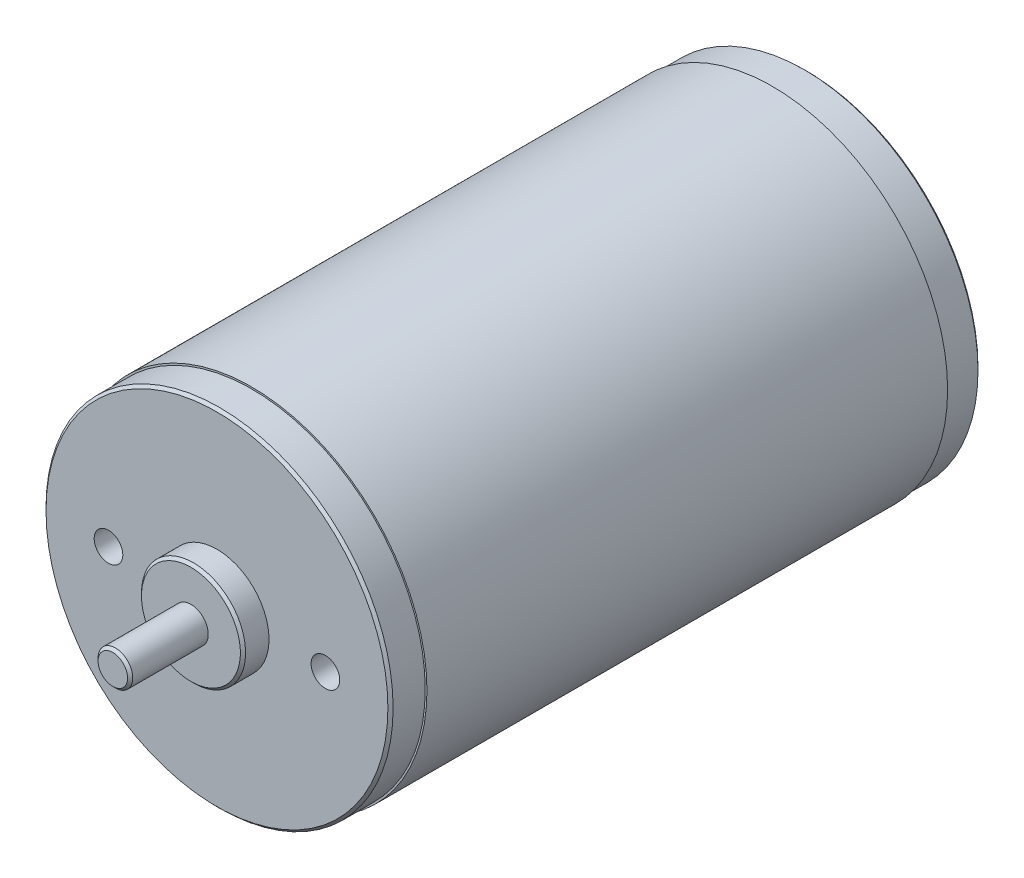
ISO-10303-21;
HEADER;
FILE_DESCRIPTION(('STEP AP214'),'2;1');
FILE_NAME('part.step','',(''),(''),'','','');
FILE_SCHEMA(('AUTOMOTIVE_DESIGN { 1 0 10303 214 1 1 1 1 }'));
ENDSEC;
DATA;
#1=APPLICATION_CONTEXT('core data for automotive mechanical design processes');
#2=APPLICATION_PROTOCOL_DEFINITION('international standard','automotive_design',2000,#1);
#3=PRODUCT_CONTEXT('',#1,'mechanical');
#4=PRODUCT('Part','Part','',(#3));
#5=PRODUCT_RELATED_PRODUCT_CATEGORY('part','',(#4));
#6=PRODUCT_DEFINITION_FORMATION('','',#4);
#7=PRODUCT_DEFINITION_CONTEXT('part definition',#1,'design');
#8=PRODUCT_DEFINITION('design','',#6,#7);
#9=PRODUCT_DEFINITION_SHAPE('','',#8);
#10=(LENGTH_UNIT() NAMED_UNIT(*) SI_UNIT(.MILLI.,.METRE.));
#11=(NAMED_UNIT(*) PLANE_ANGLE_UNIT() SI_UNIT($,.RADIAN.));
#12=(NAMED_UNIT(*) SI_UNIT($,.STERADIAN.) SOLID_ANGLE_UNIT());
#13=UNCERTAINTY_MEASURE_WITH_UNIT(LENGTH_MEASURE(1.E-05),#10,'distance_accuracy_value','');
#14=(GEOMETRIC_REPRESENTATION_CONTEXT(3) GLOBAL_UNCERTAINTY_ASSIGNED_CONTEXT((#13)) GLOBAL_UNIT_ASSIGNED_CONTEXT((#10,
#11,#12)) REPRESENTATION_CONTEXT('',''));
#15=CARTESIAN_POINT('',(0.,0.,0.));
#16=DIRECTION('',(0.,0.,1.));
#17=DIRECTION('',(1.,0.,0.));
#18=AXIS2_PLACEMENT_3D('',#15,#16,#17);
#19=CARTESIAN_POINT('',(0.,0.,12.));
#20=DIRECTION('',(0.,0.,1.));
#21=DIRECTION('',(1.,0.,0.));
#22=AXIS2_PLACEMENT_3D('',#19,#20,#21);
#23=PLANE('',#22);
#24=CARTESIAN_POINT('',(0.,0.,12.0000000000573));
#25=DIRECTION('',(0.,0.,-1.));
#26=DIRECTION('',(-1.,0.,0.));
#27=AXIS2_PLACEMENT_3D('',#24,#25,#26);
#28=CIRCLE('',#27,1.70000000002801);
#29=CARTESIAN_POINT('',(-1.70000000002801,0.,12.0000000000573));
#30=VERTEX_POINT('',#29);
#31=EDGE_CURVE('E19',#30,#30,#28,.T.);
#32=ORIENTED_EDGE('',*,*,#31,.F.);
#33=EDGE_LOOP('',(#32));
#34=FACE_BOUND('',#33,.T.);
#35=ADVANCED_FACE('F16',(#34),#23,.T.);
#36=CARTESIAN_POINT('',(0.,0.,11.7000000000758));
#37=DIRECTION('',(0.,0.,-1.));
#38=DIRECTION('',(-1.,0.,0.));
#39=AXIS2_PLACEMENT_3D('',#36,#37,#38);
#40=CONICAL_SURFACE('',#39,2.00000000000955,0.785398163397448);
#41=CARTESIAN_POINT('',(0.,0.,11.7));
#42=DIRECTION('',(0.,0.,-1.));
#43=DIRECTION('',(-1.,0.,0.));
#44=AXIS2_PLACEMENT_3D('',#41,#42,#43);
#45=CIRCLE('',#44,2.);
#46=CARTESIAN_POINT('',(-2.,0.,11.7));
#47=VERTEX_POINT('',#46);
#48=EDGE_CURVE('E52',#47,#47,#45,.T.);
#49=ORIENTED_EDGE('',*,*,#48,.F.);
#50=EDGE_LOOP('',(#49));
#51=FACE_BOUND('',#50,.T.);
#52=ORIENTED_EDGE('',*,*,#31,.T.);
#53=EDGE_LOOP('',(#52));
#54=FACE_BOUND('',#53,.T.);
#55=ADVANCED_FACE('F98',(#51,#54),#40,.T.);
#56=CARTESIAN_POINT('',(0.,0.,12.));
#57=DIRECTION('',(0.,0.,-1.));
#58=DIRECTION('',(-1.,0.,0.));
#59=AXIS2_PLACEMENT_3D('',#56,#57,#58);
#60=CYLINDRICAL_SURFACE('',#59,2.);
#61=CARTESIAN_POINT('',(0.,0.,3.));
#62=DIRECTION('',(0.,0.,-1.));
#63=DIRECTION('',(-1.,0.,0.));
#64=AXIS2_PLACEMENT_3D('',#61,#62,#63);
#65=CIRCLE('',#64,2.);
#66=CARTESIAN_POINT('',(-2.,0.,3.));
#67=VERTEX_POINT('',#66);
#68=EDGE_CURVE('E54',#67,#67,#65,.T.);
#69=ORIENTED_EDGE('',*,*,#68,.F.);
#70=EDGE_LOOP('',(#69));
#71=FACE_BOUND('',#70,.T.);
#72=ORIENTED_EDGE('',*,*,#48,.T.);
#73=EDGE_LOOP('',(#72));
#74=FACE_BOUND('',#73,.T.);
#75=ADVANCED_FACE('F94',(#71,#74),#60,.T.);
#76=CARTESIAN_POINT('',(0.,0.,-69.5));
#77=DIRECTION('',(0.,0.,-1.));
#78=DIRECTION('',(-1.,0.,0.));
#79=AXIS2_PLACEMENT_3D('',#76,#77,#78);
#80=PLANE('',#79);
#81=CARTESIAN_POINT('',(0.,0.,-69.5000000000618));
#82=DIRECTION('',(0.,0.,1.));
#83=DIRECTION('',(1.,0.,0.));
#84=AXIS2_PLACEMENT_3D('',#81,#82,#83);
#85=CIRCLE('',#84,6.02500000002237);
#86=CARTESIAN_POINT('',(6.02500000002237,0.,-69.5000000000618));
#87=VERTEX_POINT('',#86);
#88=EDGE_CURVE('E86',#87,#87,#85,.T.);
#89=ORIENTED_EDGE('',*,*,#88,.F.);
#90=EDGE_LOOP('',(#89));
#91=FACE_BOUND('',#90,.T.);
#92=ADVANCED_FACE('F97',(#91),#80,.T.);
#93=CARTESIAN_POINT('',(0.,0.,3.));
#94=DIRECTION('',(0.,0.,1.));
#95=DIRECTION('',(1.,0.,0.));
#96=AXIS2_PLACEMENT_3D('',#93,#94,#95);
#97=PLANE('',#96);
#98=ORIENTED_EDGE('',*,*,#68,.T.);
#99=EDGE_LOOP('',(#98));
#100=FACE_BOUND('',#99,.T.);
#101=CARTESIAN_POINT('',(0.,0.,2.9999999999859));
#102=DIRECTION('',(0.,0.,-1.));
#103=DIRECTION('',(-1.,0.,0.));
#104=AXIS2_PLACEMENT_3D('',#101,#102,#103);
#105=CIRCLE('',#104,5.70000000004711);
#106=CARTESIAN_POINT('',(-5.70000000004711,0.,2.9999999999859));
#107=VERTEX_POINT('',#106);
#108=EDGE_CURVE('E48',#107,#107,#105,.T.);
#109=ORIENTED_EDGE('',*,*,#108,.F.);
#110=EDGE_LOOP('',(#109));
#111=FACE_BOUND('',#110,.T.);
#112=ADVANCED_FACE('F91',(#100,#111),#97,.T.);
#113=CARTESIAN_POINT('',(0.,0.,-69.2000000000803));
#114=DIRECTION('',(0.,0.,1.));
#115=DIRECTION('',(1.,0.,0.));
#116=AXIS2_PLACEMENT_3D('',#113,#114,#115);
#117=CONICAL_SURFACE('',#116,6.32500000000391,0.785398163397448);
#118=ORIENTED_EDGE('',*,*,#88,.T.);
#119=EDGE_LOOP('',(#118));
#120=FACE_BOUND('',#119,.T.);
#121=CARTESIAN_POINT('',(0.,0.,-69.2));
#122=DIRECTION('',(0.,0.,1.));
#123=DIRECTION('',(1.,0.,0.));
#124=AXIS2_PLACEMENT_3D('',#121,#122,#123);
#125=CIRCLE('',#124,6.325);
#126=CARTESIAN_POINT('',(6.325,0.,-69.2));
#127=VERTEX_POINT('',#126);
#128=EDGE_CURVE('E42',#127,#127,#125,.T.);
#129=ORIENTED_EDGE('',*,*,#128,.F.);
#130=EDGE_LOOP('',(#129));
#131=FACE_BOUND('',#130,.T.);
#132=ADVANCED_FACE('F35',(#120,#131),#117,.T.);
#133=CARTESIAN_POINT('',(-12.5,0.,-8.10000000012678));
#134=DIRECTION('',(0.,0.,1.));
#135=DIRECTION('',(1.,0.,0.));
#136=AXIS2_PLACEMENT_3D('',#133,#134,#135);
#137=CONICAL_SURFACE('',#136,1.6499999998814,1.02974425849465);
#138=CARTESIAN_POINT('',(-12.5000000002728,0.,-9.09142002154795));
#139=VERTEX_POINT('',#138);
#140=VERTEX_LOOP('',#139);
#141=FACE_BOUND('',#140,.T.);
#142=CARTESIAN_POINT('',(-12.5,0.,-8.1));
#143=DIRECTION('',(0.,0.,1.));
#144=DIRECTION('',(1.,0.,0.));
#145=AXIS2_PLACEMENT_3D('',#142,#143,#144);
#146=CIRCLE('',#145,1.65);
#147=CARTESIAN_POINT('',(-10.85,0.,-8.1));
#148=VERTEX_POINT('',#147);
#149=EDGE_CURVE('E39',#148,#148,#146,.T.);
#150=ORIENTED_EDGE('',*,*,#149,.T.);
#151=EDGE_LOOP('',(#150));
#152=FACE_BOUND('',#151,.T.);
#153=ADVANCED_FACE('F31',(#141,#152),#137,.F.);
#154=CARTESIAN_POINT('',(12.5,0.,-8.10000000012678));
#155=DIRECTION('',(0.,0.,1.));
#156=DIRECTION('',(1.,0.,0.));
#157=AXIS2_PLACEMENT_3D('',#154,#155,#156);
#158=CONICAL_SURFACE('',#157,1.64999999985866,1.02974425848248);
#159=CARTESIAN_POINT('',(12.4999999997328,0.,-9.09142002157637));
#160=VERTEX_POINT('',#159);
#161=VERTEX_LOOP('',#160);
#162=FACE_BOUND('',#161,.T.);
#163=CARTESIAN_POINT('',(12.5,0.,-8.1));
#164=DIRECTION('',(0.,0.,1.));
#165=DIRECTION('',(1.,0.,0.));
#166=AXIS2_PLACEMENT_3D('',#163,#164,#165);
#167=CIRCLE('',#166,1.65);
#168=CARTESIAN_POINT('',(14.15,0.,-8.1));
#169=VERTEX_POINT('',#168);
#170=EDGE_CURVE('E41',#169,#169,#167,.T.);
#171=ORIENTED_EDGE('',*,*,#170,.T.);
#172=EDGE_LOOP('',(#171));
#173=FACE_BOUND('',#172,.T.);
#174=ADVANCED_FACE('F34',(#162,#173),#158,.F.);
#175=CARTESIAN_POINT('',(0.,0.,2.70000000000437));
#176=DIRECTION('',(0.,0.,-1.));
#177=DIRECTION('',(-1.,0.,0.));
#178=AXIS2_PLACEMENT_3D('',#175,#176,#177);
#179=CONICAL_SURFACE('',#178,6.00000000002865,0.785398163397448);
#180=CARTESIAN_POINT('',(0.,0.,2.70000000000002));
#181=DIRECTION('',(0.,0.,-1.));
#182=DIRECTION('',(-1.,0.,0.));
#183=AXIS2_PLACEMENT_3D('',#180,#181,#182);
#184=CIRCLE('',#183,6.);
#185=CARTESIAN_POINT('',(-6.,0.,2.70000000000002));
#186=VERTEX_POINT('',#185);
#187=EDGE_CURVE('E45',#186,#186,#184,.T.);
#188=ORIENTED_EDGE('',*,*,#187,.F.);
#189=EDGE_LOOP('',(#188));
#190=FACE_BOUND('',#189,.T.);
#191=ORIENTED_EDGE('',*,*,#108,.T.);
#192=EDGE_LOOP('',(#191));
#193=FACE_BOUND('',#192,.T.);
#194=ADVANCED_FACE('F166',(#190,#193),#179,.T.);
#195=CARTESIAN_POINT('',(0.,0.,-69.5));
#196=DIRECTION('',(0.,0.,1.));
#197=DIRECTION('',(1.,0.,0.));
#198=AXIS2_PLACEMENT_3D('',#195,#196,#197);
#199=CYLINDRICAL_SURFACE('',#198,6.325);
#200=ORIENTED_EDGE('',*,*,#128,.T.);
#201=EDGE_LOOP('',(#200));
#202=FACE_BOUND('',#201,.T.);
#203=CARTESIAN_POINT('',(0.,0.,-68.));
#204=DIRECTION('',(0.,0.,1.));
#205=DIRECTION('',(1.,0.,0.));
#206=AXIS2_PLACEMENT_3D('',#203,#204,#205);
#207=CIRCLE('',#206,6.325);
#208=CARTESIAN_POINT('',(6.325,0.,-68.));
#209=VERTEX_POINT('',#208);
#210=EDGE_CURVE('E81',#209,#209,#207,.F.);
#211=ORIENTED_EDGE('',*,*,#210,.T.);
#212=EDGE_LOOP('',(#211));
#213=FACE_BOUND('',#212,.T.);
#214=ADVANCED_FACE('F162',(#202,#213),#199,.T.);
#215=CARTESIAN_POINT('',(-12.5,0.,0.));
#216=DIRECTION('',(0.,0.,1.));
#217=DIRECTION('',(1.,0.,0.));
#218=AXIS2_PLACEMENT_3D('',#215,#216,#217);
#219=CYLINDRICAL_SURFACE('',#218,1.65);
#220=CARTESIAN_POINT('',(-12.5,0.,0.));
#221=DIRECTION('',(0.,0.,1.));
#222=DIRECTION('',(1.,0.,0.));
#223=AXIS2_PLACEMENT_3D('',#220,#221,#222);
#224=CIRCLE('',#223,1.65);
#225=CARTESIAN_POINT('',(-10.85,0.,0.));
#226=VERTEX_POINT('',#225);
#227=EDGE_CURVE('E78',#226,#226,#224,.F.);
#228=ORIENTED_EDGE('',*,*,#227,.F.);
#229=EDGE_LOOP('',(#228));
#230=FACE_BOUND('',#229,.T.);
#231=ORIENTED_EDGE('',*,*,#149,.F.);
#232=EDGE_LOOP('',(#231));
#233=FACE_BOUND('',#232,.T.);
#234=ADVANCED_FACE('F158',(#230,#233),#219,.F.);
#235=CARTESIAN_POINT('',(12.5,0.,0.));
#236=DIRECTION('',(0.,0.,1.));
#237=DIRECTION('',(1.,0.,0.));
#238=AXIS2_PLACEMENT_3D('',#235,#236,#237);
#239=CYLINDRICAL_SURFACE('',#238,1.65);
#240=CARTESIAN_POINT('',(12.5,0.,0.));
#241=DIRECTION('',(0.,0.,1.));
#242=DIRECTION('',(1.,0.,0.));
#243=AXIS2_PLACEMENT_3D('',#240,#241,#242);
#244=CIRCLE('',#243,1.65);
#245=CARTESIAN_POINT('',(14.15,0.,0.));
#246=VERTEX_POINT('',#245);
#247=EDGE_CURVE('E75',#246,#246,#244,.F.);
#248=ORIENTED_EDGE('',*,*,#247,.F.);
#249=EDGE_LOOP('',(#248));
#250=FACE_BOUND('',#249,.T.);
#251=ORIENTED_EDGE('',*,*,#170,.F.);
#252=EDGE_LOOP('',(#251));
#253=FACE_BOUND('',#252,.T.);
#254=ADVANCED_FACE('F154',(#250,#253),#239,.F.);
#255=CARTESIAN_POINT('',(0.,0.,3.));
#256=DIRECTION('',(0.,0.,-1.));
#257=DIRECTION('',(-1.,0.,0.));
#258=AXIS2_PLACEMENT_3D('',#255,#256,#257);
#259=CYLINDRICAL_SURFACE('',#258,6.);
#260=CARTESIAN_POINT('',(0.,0.,0.));
#261=DIRECTION('',(0.,0.,-1.));
#262=DIRECTION('',(-1.,0.,0.));
#263=AXIS2_PLACEMENT_3D('',#260,#261,#262);
#264=CIRCLE('',#263,6.);
#265=CARTESIAN_POINT('',(-6.,0.,0.));
#266=VERTEX_POINT('',#265);
#267=EDGE_CURVE('E72',#266,#266,#264,.T.);
#268=ORIENTED_EDGE('',*,*,#267,.F.);
#269=EDGE_LOOP('',(#268));
#270=FACE_BOUND('',#269,.T.);
#271=ORIENTED_EDGE('',*,*,#187,.T.);
#272=EDGE_LOOP('',(#271));
#273=FACE_BOUND('',#272,.T.);
#274=ADVANCED_FACE('F150',(#270,#273),#259,.T.);
#275=CARTESIAN_POINT('',(0.,0.,-68.));
#276=DIRECTION('',(0.,0.,1.));
#277=DIRECTION('',(1.,0.,0.));
#278=AXIS2_PLACEMENT_3D('',#275,#276,#277);
#279=PLANE('',#278);
#280=ORIENTED_EDGE('',*,*,#210,.F.);
#281=EDGE_LOOP('',(#280));
#282=FACE_BOUND('',#281,.T.);
#283=CARTESIAN_POINT('',(0.,0.,-68.));
#284=DIRECTION('',(0.,0.,1.));
#285=DIRECTION('',(1.,0.,0.));
#286=AXIS2_PLACEMENT_3D('',#283,#284,#285);
#287=CIRCLE('',#286,19.7);
#288=CARTESIAN_POINT('',(19.7,0.,-68.));
#289=VERTEX_POINT('',#288);
#290=EDGE_CURVE('E69',#289,#289,#287,.T.);
#291=ORIENTED_EDGE('',*,*,#290,.F.);
#292=EDGE_LOOP('',(#291));
#293=FACE_BOUND('',#292,.T.);
#294=ADVANCED_FACE('F146',(#282,#293),#279,.F.);
#295=CARTESIAN_POINT('',(0.,0.,0.));
#296=DIRECTION('',(0.,0.,1.));
#297=DIRECTION('',(1.,0.,0.));
#298=AXIS2_PLACEMENT_3D('',#295,#296,#297);
#299=PLANE('',#298);
#300=ORIENTED_EDGE('',*,*,#267,.T.);
#301=EDGE_LOOP('',(#300));
#302=FACE_BOUND('',#301,.T.);
#303=ORIENTED_EDGE('',*,*,#247,.T.);
#304=EDGE_LOOP('',(#303));
#305=FACE_BOUND('',#304,.T.);
#306=ORIENTED_EDGE('',*,*,#227,.T.);
#307=EDGE_LOOP('',(#306));
#308=FACE_BOUND('',#307,.T.);
#309=CARTESIAN_POINT('',(0.,0.,0.));
#310=DIRECTION('',(0.,0.,-1.));
#311=DIRECTION('',(-1.,0.,0.));
#312=AXIS2_PLACEMENT_3D('',#309,#310,#311);
#313=CIRCLE('',#312,19.7);
#314=CARTESIAN_POINT('',(-19.7,0.,0.));
#315=VERTEX_POINT('',#314);
#316=EDGE_CURVE('E65',#315,#315,#313,.T.);
#317=ORIENTED_EDGE('',*,*,#316,.F.);
#318=EDGE_LOOP('',(#317));
#319=FACE_BOUND('',#318,.T.);
#320=ADVANCED_FACE('F142',(#302,#305,#308,#319),#299,.T.);
#321=CARTESIAN_POINT('',(0.,0.,-67.7));
#322=DIRECTION('',(0.,0.,1.));
#323=DIRECTION('',(1.,0.,0.));
#324=AXIS2_PLACEMENT_3D('',#321,#322,#323);
#325=CONICAL_SURFACE('',#324,20.,0.785398163397466);
#326=ORIENTED_EDGE('',*,*,#290,.T.);
#327=EDGE_LOOP('',(#326));
#328=FACE_BOUND('',#327,.T.);
#329=CARTESIAN_POINT('',(0.,0.,-67.7));
#330=DIRECTION('',(0.,0.,-1.));
#331=DIRECTION('',(-1.,0.,0.));
#332=AXIS2_PLACEMENT_3D('',#329,#330,#331);
#333=CIRCLE('',#332,20.);
#334=CARTESIAN_POINT('',(-20.,0.,-67.7));
#335=VERTEX_POINT('',#334);
#336=EDGE_CURVE('E68',#335,#335,#333,.F.);
#337=ORIENTED_EDGE('',*,*,#336,.F.);
#338=EDGE_LOOP('',(#337));
#339=FACE_BOUND('',#338,.T.);
#340=ADVANCED_FACE('F138',(#328,#339),#325,.T.);
#341=CARTESIAN_POINT('',(0.,0.,-0.299999999999963));
#342=DIRECTION('',(0.,0.,-1.));
#343=DIRECTION('',(-1.,0.,0.));
#344=AXIS2_PLACEMENT_3D('',#341,#342,#343);
#345=CONICAL_SURFACE('',#344,20.,0.785398163397472);
#346=ORIENTED_EDGE('',*,*,#316,.T.);
#347=EDGE_LOOP('',(#346));
#348=FACE_BOUND('',#347,.T.);
#349=CARTESIAN_POINT('',(0.,0.,-0.299999999999964));
#350=DIRECTION('',(0.,0.,1.));
#351=DIRECTION('',(1.,0.,0.));
#352=AXIS2_PLACEMENT_3D('',#349,#350,#351);
#353=CIRCLE('',#352,20.);
#354=CARTESIAN_POINT('',(20.,0.,-0.299999999999964));
#355=VERTEX_POINT('',#354);
#356=EDGE_CURVE('E64',#355,#355,#353,.F.);
#357=ORIENTED_EDGE('',*,*,#356,.F.);
#358=EDGE_LOOP('',(#357));
#359=FACE_BOUND('',#358,.T.);
#360=ADVANCED_FACE('F134',(#348,#359),#345,.T.);
#361=CARTESIAN_POINT('',(0.,0.,-64.));
#362=DIRECTION('',(0.,0.,-1.));
#363=DIRECTION('',(-1.,0.,0.));
#364=AXIS2_PLACEMENT_3D('',#361,#362,#363);
#365=CYLINDRICAL_SURFACE('',#364,20.);
#366=CARTESIAN_POINT('',(0.,0.,-64.));
#367=DIRECTION('',(0.,0.,-1.));
#368=DIRECTION('',(-1.,0.,0.));
#369=AXIS2_PLACEMENT_3D('',#366,#367,#368);
#370=CIRCLE('',#369,20.);
#371=CARTESIAN_POINT('',(-20.,0.,-64.));
#372=VERTEX_POINT('',#371);
#373=EDGE_CURVE('E61',#372,#372,#370,.F.);
#374=ORIENTED_EDGE('',*,*,#373,.F.);
#375=EDGE_LOOP('',(#374));
#376=FACE_BOUND('',#375,.T.);
#377=ORIENTED_EDGE('',*,*,#336,.T.);
#378=EDGE_LOOP('',(#377));
#379=FACE_BOUND('',#378,.T.);
#380=ADVANCED_FACE('F130',(#376,#379),#365,.T.);
#381=CARTESIAN_POINT('',(0.,0.,-4.));
#382=DIRECTION('',(0.,0.,1.));
#383=DIRECTION('',(1.,0.,0.));
#384=AXIS2_PLACEMENT_3D('',#381,#382,#383);
#385=CYLINDRICAL_SURFACE('',#384,20.);
#386=CARTESIAN_POINT('',(0.,0.,-4.));
#387=DIRECTION('',(0.,0.,1.));
#388=DIRECTION('',(1.,0.,0.));
#389=AXIS2_PLACEMENT_3D('',#386,#387,#388);
#390=CIRCLE('',#389,20.);
#391=CARTESIAN_POINT('',(20.,0.,-4.));
#392=VERTEX_POINT('',#391);
#393=EDGE_CURVE('E58',#392,#392,#390,.F.);
#394=ORIENTED_EDGE('',*,*,#393,.F.);
#395=EDGE_LOOP('',(#394));
#396=FACE_BOUND('',#395,.T.);
#397=ORIENTED_EDGE('',*,*,#356,.T.);
#398=EDGE_LOOP('',(#397));
#399=FACE_BOUND('',#398,.T.);
#400=ADVANCED_FACE('F126',(#396,#399),#385,.T.);
#401=CARTESIAN_POINT('',(0.,0.,-64.));
#402=DIRECTION('',(0.,0.,-1.));
#403=DIRECTION('',(-1.,0.,0.));
#404=AXIS2_PLACEMENT_3D('',#401,#402,#403);
#405=PLANE('',#404);
#406=CARTESIAN_POINT('',(0.,0.,-64.));
#407=DIRECTION('',(0.,0.,1.));
#408=DIRECTION('',(1.,0.,0.));
#409=AXIS2_PLACEMENT_3D('',#406,#407,#408);
#410=CIRCLE('',#409,20.2);
#411=CARTESIAN_POINT('',(20.2,0.,-64.));
#412=VERTEX_POINT('',#411);
#413=EDGE_CURVE('E25',#412,#412,#410,.T.);
#414=ORIENTED_EDGE('',*,*,#413,.F.);
#415=EDGE_LOOP('',(#414));
#416=FACE_BOUND('',#415,.T.);
#417=ORIENTED_EDGE('',*,*,#373,.T.);
#418=EDGE_LOOP('',(#417));
#419=FACE_BOUND('',#418,.T.);
#420=ADVANCED_FACE('F119',(#416,#419),#405,.T.);
#421=CARTESIAN_POINT('',(0.,0.,-4.));
#422=DIRECTION('',(0.,0.,1.));
#423=DIRECTION('',(1.,0.,0.));
#424=AXIS2_PLACEMENT_3D('',#421,#422,#423);
#425=PLANE('',#424);
#426=CARTESIAN_POINT('',(0.,0.,-4.));
#427=DIRECTION('',(0.,0.,1.));
#428=DIRECTION('',(1.,0.,0.));
#429=AXIS2_PLACEMENT_3D('',#426,#427,#428);
#430=CIRCLE('',#429,20.2);
#431=CARTESIAN_POINT('',(20.2,0.,-4.));
#432=VERTEX_POINT('',#431);
#433=EDGE_CURVE('E11',#432,#432,#430,.F.);
#434=ORIENTED_EDGE('',*,*,#433,.F.);
#435=EDGE_LOOP('',(#434));
#436=FACE_BOUND('',#435,.T.);
#437=ORIENTED_EDGE('',*,*,#393,.T.);
#438=EDGE_LOOP('',(#437));
#439=FACE_BOUND('',#438,.T.);
#440=ADVANCED_FACE('F113',(#436,#439),#425,.T.);
#441=CARTESIAN_POINT('',(0.,0.,-68.));
#442=DIRECTION('',(0.,0.,1.));
#443=DIRECTION('',(1.,0.,0.));
#444=AXIS2_PLACEMENT_3D('',#441,#442,#443);
#445=CYLINDRICAL_SURFACE('',#444,20.2);
#446=ORIENTED_EDGE('',*,*,#433,.T.);
#447=EDGE_LOOP('',(#446));
#448=FACE_BOUND('',#447,.T.);
#449=ORIENTED_EDGE('',*,*,#413,.T.);
#450=EDGE_LOOP('',(#449));
#451=FACE_BOUND('',#450,.T.);
#452=ADVANCED_FACE('F111',(#448,#451),#445,.T.);
#453=CLOSED_SHELL('',(#35,#55,#75,#92,#112,#132,#153,#174,#194,#214,#234,#254,#274,#294,#320,
#340,#360,#380,#400,#420,#440,#452));
#454=MANIFOLD_SOLID_BREP('B1',#453);
#455=ADVANCED_BREP_SHAPE_REPRESENTATION('',(#18,#454),#14);
#456=SHAPE_DEFINITION_REPRESENTATION(#9,#455);
ENDSEC;
END-ISO-10303-21;
